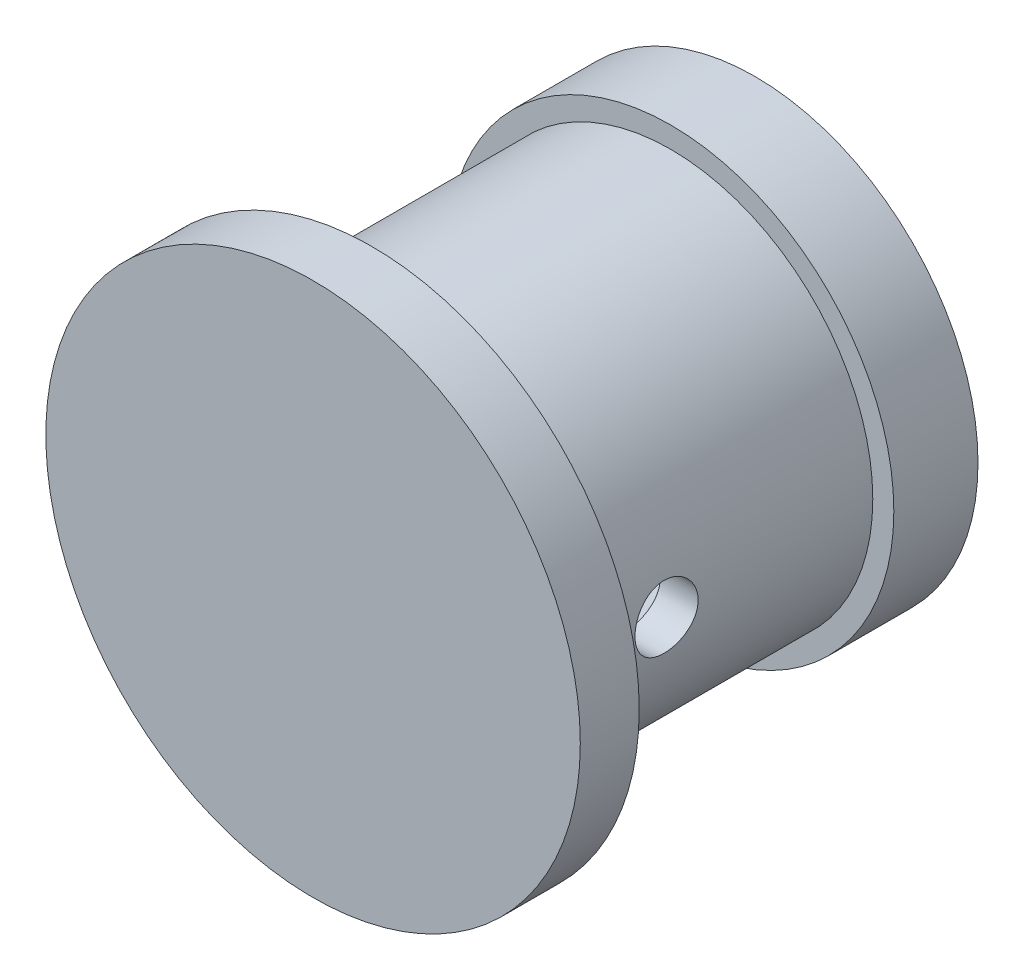
ISO-10303-21;
HEADER;
FILE_DESCRIPTION(('STEP AP214'),'2;1');
FILE_NAME('part.step','',(''),(''),'','','');
FILE_SCHEMA(('AUTOMOTIVE_DESIGN { 1 0 10303 214 1 1 1 1 }'));
ENDSEC;
DATA;
#1=APPLICATION_CONTEXT('core data for automotive mechanical design processes');
#2=APPLICATION_PROTOCOL_DEFINITION('international standard','automotive_design',2000,#1);
#3=PRODUCT_CONTEXT('',#1,'mechanical');
#4=PRODUCT('Part','Part','',(#3));
#5=PRODUCT_RELATED_PRODUCT_CATEGORY('part','',(#4));
#6=PRODUCT_DEFINITION_FORMATION('','',#4);
#7=PRODUCT_DEFINITION_CONTEXT('part definition',#1,'design');
#8=PRODUCT_DEFINITION('design','',#6,#7);
#9=PRODUCT_DEFINITION_SHAPE('','',#8);
#10=(LENGTH_UNIT() NAMED_UNIT(*) SI_UNIT(.MILLI.,.METRE.));
#11=(NAMED_UNIT(*) PLANE_ANGLE_UNIT() SI_UNIT($,.RADIAN.));
#12=(NAMED_UNIT(*) SI_UNIT($,.STERADIAN.) SOLID_ANGLE_UNIT());
#13=UNCERTAINTY_MEASURE_WITH_UNIT(LENGTH_MEASURE(1.E-05),#10,'distance_accuracy_value','');
#14=(GEOMETRIC_REPRESENTATION_CONTEXT(3) GLOBAL_UNCERTAINTY_ASSIGNED_CONTEXT((#13)) GLOBAL_UNIT_ASSIGNED_CONTEXT((#10,
#11,#12)) REPRESENTATION_CONTEXT('',''));
#15=CARTESIAN_POINT('',(0.,0.,0.));
#16=DIRECTION('',(0.,0.,1.));
#17=DIRECTION('',(1.,0.,0.));
#18=AXIS2_PLACEMENT_3D('',#15,#16,#17);
#19=CARTESIAN_POINT('',(0.,0.,2.));
#20=DIRECTION('',(0.,0.,-1.));
#21=DIRECTION('',(-1.,0.,0.));
#22=AXIS2_PLACEMENT_3D('',#19,#20,#21);
#23=CYLINDRICAL_SURFACE('',#22,3.9);
#24=CARTESIAN_POINT('',(0.,0.,0.));
#25=DIRECTION('',(0.,0.,1.));
#26=DIRECTION('',(1.,0.,0.));
#27=AXIS2_PLACEMENT_3D('',#24,#25,#26);
#28=CIRCLE('',#27,3.9);
#29=CARTESIAN_POINT('',(3.9,0.,0.));
#30=VERTEX_POINT('',#29);
#31=EDGE_CURVE('E44',#30,#30,#28,.T.);
#32=ORIENTED_EDGE('',*,*,#31,.F.);
#33=EDGE_LOOP('',(#32));
#34=FACE_BOUND('',#33,.T.);
#35=CARTESIAN_POINT('',(3.9,0.,6.15));
#36=CARTESIAN_POINT('',(3.89999923832951,-0.0417157980542261,6.15000157236591));
#37=CARTESIAN_POINT('',(3.89932379420987,-0.0834518319216465,6.1534921761894));
#38=CARTESIAN_POINT('',(3.89669443486819,-0.165746439927408,6.16735258345867));
#39=CARTESIAN_POINT('',(3.89473946456115,-0.20630401346838,6.17772806420581));
#40=CARTESIAN_POINT('',(3.88976959480018,-0.285039761238712,6.20502767414644));
#41=CARTESIAN_POINT('',(3.88675567477839,-0.323220095914121,6.22194575348209));
#42=CARTESIAN_POINT('',(3.87999646463515,-0.396197171527076,6.26183283837788));
#43=CARTESIAN_POINT('',(3.87625122778612,-0.430994158646533,6.28480140323585));
#44=CARTESIAN_POINT('',(3.86838969007306,-0.496657298922666,6.33644374971233));
#45=CARTESIAN_POINT('',(3.8642696864585,-0.527474788610262,6.36517884943533));
#46=CARTESIAN_POINT('',(3.856150240852,-0.58388300584685,6.4274067111584));
#47=CARTESIAN_POINT('',(3.85215080781833,-0.609473345836056,6.46089982562297));
#48=CARTESIAN_POINT('',(3.84468928205856,-0.654905038861865,6.53203919860734));
#49=CARTESIAN_POINT('',(3.84123195979528,-0.674696554350678,6.5697178293301));
#50=CARTESIAN_POINT('',(3.83529843768219,-0.707649660945562,6.64794297300797));
#51=CARTESIAN_POINT('',(3.83282214860921,-0.720811855005835,6.68848922476273));
#52=CARTESIAN_POINT('',(3.82916841038291,-0.739975831371414,6.77077685751576));
#53=CARTESIAN_POINT('',(3.82797554466172,-0.746062676374626,6.81249773000912));
#54=CARTESIAN_POINT('',(3.82697726327835,-0.751167270554283,6.896384291076));
#55=CARTESIAN_POINT('',(3.82717171663926,-0.750185687061576,6.93854993728307));
#56=CARTESIAN_POINT('',(3.82891207752539,-0.74125018682566,7.02151056694862));
#57=CARTESIAN_POINT('',(3.83043917839865,-0.733393291950161,7.06231645342943));
#58=CARTESIAN_POINT('',(3.83464320117064,-0.711083124407333,7.14201989493467));
#59=CARTESIAN_POINT('',(3.83732017422218,-0.696629558280993,7.18091736497618));
#60=CARTESIAN_POINT('',(3.84354181057073,-0.661442296377936,7.25598208314585));
#61=CARTESIAN_POINT('',(3.84709182212181,-0.640669696791684,7.2921306331524));
#62=CARTESIAN_POINT('',(3.85465604131889,-0.593461515268042,7.36046549134157));
#63=CARTESIAN_POINT('',(3.85867029841497,-0.567025329805939,7.39265137667751));
#64=CARTESIAN_POINT('',(3.86679247142909,-0.508718673398003,7.45270756026625));
#65=CARTESIAN_POINT('',(3.87090083596183,-0.476765283467978,7.48049735701104));
#66=CARTESIAN_POINT('',(3.87868716308693,-0.408607996846195,7.53033465219016));
#67=CARTESIAN_POINT('',(3.88236512092762,-0.372404053237343,7.55238208723235));
#68=CARTESIAN_POINT('',(3.88888424583095,-0.296687328746638,7.5901218141119));
#69=CARTESIAN_POINT('',(3.89172426781904,-0.25717011391292,7.60580542038515));
#70=CARTESIAN_POINT('',(3.89623874164927,-0.175995170759134,7.63028922700407));
#71=CARTESIAN_POINT('',(3.8979133238481,-0.134337682392701,7.63909019719956));
#72=CARTESIAN_POINT('',(3.89989023849144,-0.0507569745433844,7.64944612984607));
#73=CARTESIAN_POINT('',(3.90021344806363,-0.00884789339859487,7.65111134155231));
#74=CARTESIAN_POINT('',(3.89950898996532,0.0746497909778481,7.64744466684101));
#75=CARTESIAN_POINT('',(3.8984813922618,0.116238410696026,7.6421131428293));
#76=CARTESIAN_POINT('',(3.89520380615872,0.197562672774067,7.62469597680149));
#77=CARTESIAN_POINT('',(3.89296397194081,0.237310771117499,7.61266641647227));
#78=CARTESIAN_POINT('',(3.88751206346573,0.314225866800569,7.58225556596267));
#79=CARTESIAN_POINT('',(3.88429992056438,0.351392681675911,7.56387382731082));
#80=CARTESIAN_POINT('',(3.8772076396041,0.422558604801738,7.52103847704758));
#81=CARTESIAN_POINT('',(3.87332028676074,0.456516655578994,7.49651787253896));
#82=CARTESIAN_POINT('',(3.86532676553627,0.51987558162931,7.44219113295079));
#83=CARTESIAN_POINT('',(3.86122057561335,0.54927600714268,7.41238447684981));
#84=CARTESIAN_POINT('',(3.85318249151767,0.603106530494588,7.34783155158119));
#85=CARTESIAN_POINT('',(3.84925384547182,0.627461217715537,7.31302192491511));
#86=CARTESIAN_POINT('',(3.84208231127829,0.669977846499952,7.239740902718));
#87=CARTESIAN_POINT('',(3.83883939686218,0.688140025297119,7.20126964753543));
#88=CARTESIAN_POINT('',(3.83343227195322,0.717650652563154,7.12194409231613));
#89=CARTESIAN_POINT('',(3.8312627147556,0.729032932785833,7.08110275995974));
#90=CARTESIAN_POINT('',(3.82823606196423,0.744764371630338,6.99804147803805));
#91=CARTESIAN_POINT('',(3.82737880966904,0.749114369975666,6.95582169368778));
#92=CARTESIAN_POINT('',(3.8270820615194,0.750628535062043,6.87195799322353));
#93=CARTESIAN_POINT('',(3.82761908113154,0.747911730636622,6.83031626310977));
#94=CARTESIAN_POINT('',(3.82999814389848,0.735630799614123,6.74809501664808));
#95=CARTESIAN_POINT('',(3.83184017827541,0.726066719073556,6.70751549315737));
#96=CARTESIAN_POINT('',(3.83661159778881,0.700414043152496,6.6286390140474));
#97=CARTESIAN_POINT('',(3.83953872620097,0.684338982601164,6.59033751122471));
#98=CARTESIAN_POINT('',(3.84615199601922,0.646133912356583,6.51695629143272));
#99=CARTESIAN_POINT('',(3.84983819486471,0.624003444404754,6.48187681856732));
#100=CARTESIAN_POINT('',(3.8576267709082,0.573904691443286,6.41534052759461));
#101=CARTESIAN_POINT('',(3.86173478389533,0.545850029561536,6.38394939555536));
#102=CARTESIAN_POINT('',(3.86986260948437,0.484878715455026,6.32628078735171));
#103=CARTESIAN_POINT('',(3.87388240161115,0.451960947978224,6.30000448737957));
#104=CARTESIAN_POINT('',(3.88142597117673,0.38182087720399,6.25307609494333));
#105=CARTESIAN_POINT('',(3.8849446470373,0.344560480460825,6.23248008897926));
#106=CARTESIAN_POINT('',(3.89103957230098,0.267051677805124,6.19787376229078));
#107=CARTESIAN_POINT('',(3.89361669298088,0.226806075988456,6.18385734963933));
#108=CARTESIAN_POINT('',(3.89702203125066,0.155377069711663,6.16560462473562));
#109=CARTESIAN_POINT('',(3.89813237701001,0.124607231910502,6.1597630530743));
#110=CARTESIAN_POINT('',(3.89962163686166,0.0625620475544051,6.15196020490889));
#111=CARTESIAN_POINT('',(3.90000057125043,0.0312867150510979,6.1499988207306));
#112=CARTESIAN_POINT('',(3.9,0.,6.15));
#113=B_SPLINE_CURVE_WITH_KNOTS('',3,(#35,#36,#37,#38,#39,#40,#41,#42,#43,#44,#45,#46,#47,#48,
#49,#50,#51,#52,#53,#54,#55,#56,#57,#58,#59,#60,#61,#62,#63,#64,#65,#66,#67,#68,#69,#70,#71,#72,
#73,#74,#75,#76,#77,#78,#79,#80,#81,#82,#83,#84,#85,#86,#87,#88,#89,#90,#91,#92,#93,#94,#95,#96,
#97,#98,#99,#100,#101,#102,#103,#104,#105,#106,#107,#108,#109,#110,#111,#112),.UNSPECIFIED.,.T.,
.F.,(4,2,2,2,2,2,2,2,2,2,2,2,2,2,2,2,2,2,2,2,2,2,2,2,2,2,2,2,2,2,2,2,2,2,2,2,2,2,4),(0.,
0.125032962171771,0.250169155438955,0.375189912471988,0.500201565823747,0.626620597212298,
0.753048998365571,0.880534085472724,1.00800757538145,1.13393213695448,1.25984481013637,
1.38400879409832,1.50817830214821,1.63312829961092,1.75809161866104,1.88512918072696,
2.01216814514987,2.13937991802013,2.26657745971899,2.39180251709859,2.51702108852493,
2.6412066554825,2.76540099188296,2.89101471286217,3.01664082188772,3.1440270742995,
3.27140844602218,3.39814873963493,3.52487389809408,3.64947845137064,3.77408216653334,
3.89842817785498,4.02278360198573,4.14909571295895,4.27543683608095,4.40298408082016,
4.53041299779219,4.62418992164049,4.71796424316678),.UNSPECIFIED.);
#114=CARTESIAN_POINT('',(3.9,0.,6.15));
#115=VERTEX_POINT('',#114);
#116=EDGE_CURVE('E76',#115,#115,#113,.T.);
#117=ORIENTED_EDGE('',*,*,#116,.F.);
#118=EDGE_LOOP('',(#117));
#119=FACE_BOUND('',#118,.T.);
#120=CARTESIAN_POINT('',(-3.9,0.,7.65));
#121=CARTESIAN_POINT('',(-3.89999923832951,-0.0417157980542261,7.64999842763409));
#122=CARTESIAN_POINT('',(-3.89932379420987,-0.0834518319216465,7.6465078238106));
#123=CARTESIAN_POINT('',(-3.89669443486819,-0.165746439927408,7.63264741654133));
#124=CARTESIAN_POINT('',(-3.89473946456115,-0.20630401346838,7.62227193579419));
#125=CARTESIAN_POINT('',(-3.88976959480018,-0.285039761238712,7.59497232585356));
#126=CARTESIAN_POINT('',(-3.88675567477839,-0.323220095914121,7.57805424651791));
#127=CARTESIAN_POINT('',(-3.87999646463515,-0.396197171527076,7.53816716162212));
#128=CARTESIAN_POINT('',(-3.87625122778612,-0.430994158646533,7.51519859676415));
#129=CARTESIAN_POINT('',(-3.86838969007306,-0.496657298922666,7.46355625028766));
#130=CARTESIAN_POINT('',(-3.8642696864585,-0.527474788610262,7.43482115056467));
#131=CARTESIAN_POINT('',(-3.856150240852,-0.58388300584685,7.3725932888416));
#132=CARTESIAN_POINT('',(-3.85215080781833,-0.609473345836056,7.33910017437703));
#133=CARTESIAN_POINT('',(-3.84468928205856,-0.654905038861865,7.26796080139266));
#134=CARTESIAN_POINT('',(-3.84123195979528,-0.674696554350678,7.2302821706699));
#135=CARTESIAN_POINT('',(-3.83529843768219,-0.707649660945562,7.15205702699203));
#136=CARTESIAN_POINT('',(-3.83282214860921,-0.720811855005835,7.11151077523727));
#137=CARTESIAN_POINT('',(-3.82916841038291,-0.739975831371414,7.02922314248424));
#138=CARTESIAN_POINT('',(-3.82797554466172,-0.746062676374626,6.98750226999088));
#139=CARTESIAN_POINT('',(-3.82697726327835,-0.751167270554283,6.903615708924));
#140=CARTESIAN_POINT('',(-3.82717171663926,-0.750185687061576,6.86145006271693));
#141=CARTESIAN_POINT('',(-3.82891207752539,-0.74125018682566,6.77848943305138));
#142=CARTESIAN_POINT('',(-3.83043917839865,-0.733393291950161,6.73768354657057));
#143=CARTESIAN_POINT('',(-3.83464320117064,-0.711083124407333,6.65798010506533));
#144=CARTESIAN_POINT('',(-3.83732017422218,-0.696629558280993,6.61908263502382));
#145=CARTESIAN_POINT('',(-3.84354181057073,-0.661442296377936,6.54401791685415));
#146=CARTESIAN_POINT('',(-3.84709182212181,-0.640669696791685,6.5078693668476));
#147=CARTESIAN_POINT('',(-3.85465604131889,-0.593461515268042,6.43953450865843));
#148=CARTESIAN_POINT('',(-3.85867029841497,-0.567025329805939,6.40734862332249));
#149=CARTESIAN_POINT('',(-3.86679247142909,-0.508718673398003,6.34729243973375));
#150=CARTESIAN_POINT('',(-3.87090083596183,-0.476765283467979,6.31950264298896));
#151=CARTESIAN_POINT('',(-3.87868716308693,-0.408607996846196,6.26966534780984));
#152=CARTESIAN_POINT('',(-3.88236512092762,-0.372404053237343,6.24761791276766));
#153=CARTESIAN_POINT('',(-3.88888424583095,-0.296687328746638,6.2098781858881));
#154=CARTESIAN_POINT('',(-3.89172426781904,-0.25717011391292,6.19419457961485));
#155=CARTESIAN_POINT('',(-3.89623874164927,-0.175995170759135,6.16971077299593));
#156=CARTESIAN_POINT('',(-3.8979133238481,-0.134337682392701,6.16090980280044));
#157=CARTESIAN_POINT('',(-3.89989023849144,-0.0507569745433844,6.15055387015393));
#158=CARTESIAN_POINT('',(-3.90021344806363,-0.00884789339859488,6.14888865844769));
#159=CARTESIAN_POINT('',(-3.89950898996532,0.074649790977848,6.15255533315899));
#160=CARTESIAN_POINT('',(-3.8984813922618,0.116238410696026,6.1578868571707));
#161=CARTESIAN_POINT('',(-3.89520380615872,0.197562672774067,6.17530402319851));
#162=CARTESIAN_POINT('',(-3.89296397194081,0.237310771117499,6.18733358352773));
#163=CARTESIAN_POINT('',(-3.88751206346573,0.314225866800569,6.21774443403733));
#164=CARTESIAN_POINT('',(-3.88429992056438,0.351392681675911,6.23612617268918));
#165=CARTESIAN_POINT('',(-3.8772076396041,0.422558604801738,6.27896152295242));
#166=CARTESIAN_POINT('',(-3.87332028676074,0.456516655578994,6.30348212746104));
#167=CARTESIAN_POINT('',(-3.86532676553627,0.51987558162931,6.35780886704921));
#168=CARTESIAN_POINT('',(-3.86122057561335,0.54927600714268,6.38761552315019));
#169=CARTESIAN_POINT('',(-3.85318249151767,0.603106530494589,6.45216844841881));
#170=CARTESIAN_POINT('',(-3.84925384547182,0.627461217715537,6.48697807508489));
#171=CARTESIAN_POINT('',(-3.84208231127829,0.669977846499953,6.560259097282));
#172=CARTESIAN_POINT('',(-3.83883939686218,0.688140025297119,6.59873035246457));
#173=CARTESIAN_POINT('',(-3.83343227195322,0.717650652563155,6.67805590768387));
#174=CARTESIAN_POINT('',(-3.8312627147556,0.729032932785833,6.71889724004026));
#175=CARTESIAN_POINT('',(-3.82823606196423,0.744764371630338,6.80195852196195));
#176=CARTESIAN_POINT('',(-3.82737880966904,0.749114369975666,6.84417830631222));
#177=CARTESIAN_POINT('',(-3.8270820615194,0.750628535062043,6.92804200677647));
#178=CARTESIAN_POINT('',(-3.82761908113154,0.747911730636622,6.96968373689023));
#179=CARTESIAN_POINT('',(-3.82999814389848,0.735630799614123,7.05190498335192));
#180=CARTESIAN_POINT('',(-3.83184017827541,0.726066719073556,7.09248450684263));
#181=CARTESIAN_POINT('',(-3.83661159778881,0.700414043152496,7.1713609859526));
#182=CARTESIAN_POINT('',(-3.83953872620097,0.684338982601164,7.20966248877529));
#183=CARTESIAN_POINT('',(-3.84615199601922,0.646133912356583,7.28304370856728));
#184=CARTESIAN_POINT('',(-3.84983819486471,0.624003444404754,7.31812318143268));
#185=CARTESIAN_POINT('',(-3.8576267709082,0.573904691443286,7.38465947240539));
#186=CARTESIAN_POINT('',(-3.86173478389533,0.545850029561536,7.41605060444464));
#187=CARTESIAN_POINT('',(-3.86986260948437,0.484878715455026,7.47371921264829));
#188=CARTESIAN_POINT('',(-3.87388240161115,0.451960947978224,7.49999551262043));
#189=CARTESIAN_POINT('',(-3.88142597117673,0.38182087720399,7.54692390505667));
#190=CARTESIAN_POINT('',(-3.8849446470373,0.344560480460825,7.56751991102074));
#191=CARTESIAN_POINT('',(-3.89103957230098,0.267051677805124,7.60212623770922));
#192=CARTESIAN_POINT('',(-3.89361669298088,0.226806075988456,7.61614265036067));
#193=CARTESIAN_POINT('',(-3.89702203125066,0.155377069711663,7.63439537526438));
#194=CARTESIAN_POINT('',(-3.89813237701001,0.124607231910502,7.6402369469257));
#195=CARTESIAN_POINT('',(-3.89962163686166,0.0625620475544051,7.64803979509111));
#196=CARTESIAN_POINT('',(-3.90000057125043,0.0312867150510979,7.6500011792694));
#197=CARTESIAN_POINT('',(-3.9,0.,7.65));
#198=B_SPLINE_CURVE_WITH_KNOTS('',3,(#120,#121,#122,#123,#124,#125,#126,#127,#128,#129,#130,
#131,#132,#133,#134,#135,#136,#137,#138,#139,#140,#141,#142,#143,#144,#145,#146,#147,#148,#149,
#150,#151,#152,#153,#154,#155,#156,#157,#158,#159,#160,#161,#162,#163,#164,#165,#166,#167,#168,
#169,#170,#171,#172,#173,#174,#175,#176,#177,#178,#179,#180,#181,#182,#183,#184,#185,#186,#187,
#188,#189,#190,#191,#192,#193,#194,#195,#196,#197),.UNSPECIFIED.,.T.,.F.,(4,2,2,2,2,2,2,2,2,2,2,
2,2,2,2,2,2,2,2,2,2,2,2,2,2,2,2,2,2,2,2,2,2,2,2,2,2,2,4),(0.,0.125032962171771,
0.250169155438955,0.375189912471988,0.500201565823747,0.626620597212298,0.753048998365571,
0.880534085472724,1.00800757538145,1.13393213695448,1.25984481013637,1.38400879409832,
1.50817830214821,1.63312829961092,1.75809161866104,1.88512918072696,2.01216814514987,
2.13937991802013,2.26657745971899,2.39180251709859,2.51702108852493,2.6412066554825,
2.76540099188296,2.89101471286217,3.01664082188772,3.14402707429951,3.27140844602218,
3.39814873963493,3.52487389809408,3.64947845137064,3.77408216653334,3.89842817785498,
4.02278360198573,4.14909571295895,4.27543683608095,4.40298408082016,4.53041299779219,
4.62418992164049,4.71796424316678),.UNSPECIFIED.);
#199=CARTESIAN_POINT('',(-3.9,0.,7.65));
#200=VERTEX_POINT('',#199);
#201=EDGE_CURVE('E81',#200,#200,#198,.T.);
#202=ORIENTED_EDGE('',*,*,#201,.F.);
#203=EDGE_LOOP('',(#202));
#204=FACE_BOUND('',#203,.T.);
#205=CARTESIAN_POINT('',(0.,0.,9.1));
#206=DIRECTION('',(0.,0.,1.));
#207=DIRECTION('',(1.,0.,0.));
#208=AXIS2_PLACEMENT_3D('',#205,#206,#207);
#209=CIRCLE('',#208,3.9);
#210=CARTESIAN_POINT('',(3.9,0.,9.1));
#211=VERTEX_POINT('',#210);
#212=EDGE_CURVE('E56',#211,#211,#209,.T.);
#213=ORIENTED_EDGE('',*,*,#212,.T.);
#214=EDGE_LOOP('',(#213));
#215=FACE_BOUND('',#214,.T.);
#216=ADVANCED_FACE('F28',(#34,#119,#204,#215),#23,.F.);
#217=CARTESIAN_POINT('',(0.,0.,9.5));
#218=DIRECTION('',(0.,0.,-1.));
#219=DIRECTION('',(-1.,0.,0.));
#220=AXIS2_PLACEMENT_3D('',#217,#218,#219);
#221=CYLINDRICAL_SURFACE('',#220,4.8);
#222=CARTESIAN_POINT('',(0.,0.,2.));
#223=DIRECTION('',(0.,0.,1.));
#224=DIRECTION('',(1.,0.,0.));
#225=AXIS2_PLACEMENT_3D('',#222,#223,#224);
#226=CIRCLE('',#225,4.8);
#227=CARTESIAN_POINT('',(4.8,0.,2.));
#228=VERTEX_POINT('',#227);
#229=EDGE_CURVE('E103',#228,#228,#226,.T.);
#230=ORIENTED_EDGE('',*,*,#229,.T.);
#231=EDGE_LOOP('',(#230));
#232=FACE_BOUND('',#231,.T.);
#233=CARTESIAN_POINT('',(4.8,0.,6.15));
#234=CARTESIAN_POINT('',(4.79999931058345,-0.0418545291813098,6.15000170948145));
#235=CARTESIAN_POINT('',(4.79944683745722,-0.0837328214597111,6.15351543413207));
#236=CARTESIAN_POINT('',(4.79729609429278,-0.166317394493431,6.16747310738303));
#237=CARTESIAN_POINT('',(4.79569682653417,-0.207022518396995,6.17792366775105));
#238=CARTESIAN_POINT('',(4.79163209149733,-0.286053761414221,6.20543389884199));
#239=CARTESIAN_POINT('',(4.78916729868952,-0.324381705686971,6.22248842440848));
#240=CARTESIAN_POINT('',(4.78364338211446,-0.39762637531338,6.26270956354248));
#241=CARTESIAN_POINT('',(4.78058433558766,-0.432543543110492,6.28587538291078));
#242=CARTESIAN_POINT('',(4.77418280524307,-0.498275973495485,6.33786991450619));
#243=CARTESIAN_POINT('',(4.77083835417701,-0.529058243742794,6.36674009846707));
#244=CARTESIAN_POINT('',(4.76425822839086,-0.58536230646847,6.42923458448067));
#245=CARTESIAN_POINT('',(4.76102256015224,-0.610883785962576,6.46285916919006));
#246=CARTESIAN_POINT('',(4.75500728438233,-0.656071632986651,6.53413148140312));
#247=CARTESIAN_POINT('',(4.75223021935831,-0.675705820673975,6.57179984470854));
#248=CARTESIAN_POINT('',(4.7474736052271,-0.708356044791196,6.64995042325734));
#249=CARTESIAN_POINT('',(4.74549400890665,-0.72137247303019,6.69043247175317));
#250=CARTESIAN_POINT('',(4.74257590353311,-0.740314677966502,6.77271327034314));
#251=CARTESIAN_POINT('',(4.74162907959709,-0.746297116462488,6.81449867574564));
#252=CARTESIAN_POINT('',(4.74085851321532,-0.751177109272865,6.89849015666779));
#253=CARTESIAN_POINT('',(4.74103470086407,-0.750075104581398,6.94069620583981));
#254=CARTESIAN_POINT('',(4.74248265136562,-0.740863742426671,7.0239291095558));
#255=CARTESIAN_POINT('',(4.74374451655484,-0.73281768887908,7.06496316700594));
#256=CARTESIAN_POINT('',(4.74720616903642,-0.710045813501255,7.1450916019078));
#257=CARTESIAN_POINT('',(4.74940598491924,-0.695319788052397,7.18418592019216));
#258=CARTESIAN_POINT('',(4.75450652056387,-0.659540750848154,7.25951661380315));
#259=CARTESIAN_POINT('',(4.75741017926173,-0.638461116946647,7.29574013753192));
#260=CARTESIAN_POINT('',(4.76358913845029,-0.590592174439912,7.36415986070566));
#261=CARTESIAN_POINT('',(4.76686446536463,-0.56380245975905,7.39635577346624));
#262=CARTESIAN_POINT('',(4.77346135874669,-0.504927266466999,7.45617307398999));
#263=CARTESIAN_POINT('',(4.77678304090677,-0.472787401681618,7.48374094748084));
#264=CARTESIAN_POINT('',(4.78306537604348,-0.404309084213808,7.53309994369197));
#265=CARTESIAN_POINT('',(4.78602602718607,-0.367970610204396,7.55489103706705));
#266=CARTESIAN_POINT('',(4.79125619708111,-0.292078778116948,7.59208142202672));
#267=CARTESIAN_POINT('',(4.7935252456258,-0.252523255872138,7.6074763675599));
#268=CARTESIAN_POINT('',(4.79711268000203,-0.171344860409028,7.63138979023417));
#269=CARTESIAN_POINT('',(4.79843113562693,-0.12972213920616,7.63990877221995));
#270=CARTESIAN_POINT('',(4.79995953518183,-0.0460525010291202,7.64975678293506));
#271=CARTESIAN_POINT('',(4.80018081537858,-0.0040144384526102,7.65115934369285));
#272=CARTESIAN_POINT('',(4.79952085947381,0.0796963639234929,7.64693018839921));
#273=CARTESIAN_POINT('',(4.79863966049893,0.121369115977547,7.64129870922327));
#274=CARTESIAN_POINT('',(4.79588077107966,0.202942033879711,7.62322248369595));
#275=CARTESIAN_POINT('',(4.79400835264616,0.242850378616812,7.61081377251968));
#276=CARTESIAN_POINT('',(4.78947622705067,0.320020220356988,7.57957347168036));
#277=CARTESIAN_POINT('',(4.78681648023022,0.357281583911822,7.5607415584672));
#278=CARTESIAN_POINT('',(4.78097691822283,0.428421660675122,7.51701840266203));
#279=CARTESIAN_POINT('',(4.77779318599026,0.462271537135117,7.49208077397286));
#280=CARTESIAN_POINT('',(4.77127164139331,0.525332089523418,7.43691837422766));
#281=CARTESIAN_POINT('',(4.76793381927803,0.554542471341053,7.40669326823854));
#282=CARTESIAN_POINT('',(4.76144408260995,0.607764242330072,7.34148564083484));
#283=CARTESIAN_POINT('',(4.75829412357241,0.631726195752379,7.3064625458633));
#284=CARTESIAN_POINT('',(4.75257207841748,0.673426703179921,7.2328451779016));
#285=CARTESIAN_POINT('',(4.74999997566599,0.691165436334315,7.19425100775316));
#286=CARTESIAN_POINT('',(4.74573921405707,0.719840315834984,7.11473110778574));
#287=CARTESIAN_POINT('',(4.74404724704688,0.730801964843737,7.07381475937031));
#288=CARTESIAN_POINT('',(4.74172971084238,0.745692366121606,6.99069325690081));
#289=CARTESIAN_POINT('',(4.74110406115332,0.749621649254992,6.9484882003743));
#290=CARTESIAN_POINT('',(4.74099317413465,0.750322358072269,6.86448038522776));
#291=CARTESIAN_POINT('',(4.7414955481287,0.747171541645276,6.82267827091995));
#292=CARTESIAN_POINT('',(4.74355709682549,0.733968669767703,6.74020641085671));
#293=CARTESIAN_POINT('',(4.74511626923985,0.723916629260884,6.69953666264949));
#294=CARTESIAN_POINT('',(4.74911126656472,0.697224989675555,6.62050865200784));
#295=CARTESIAN_POINT('',(4.75154630686022,0.680591285215743,6.58214835652248));
#296=CARTESIAN_POINT('',(4.75701955214219,0.641216305639252,6.50875031589712));
#297=CARTESIAN_POINT('',(4.76005778103248,0.618474788462658,6.47371270251347));
#298=CARTESIAN_POINT('',(4.76643470427678,0.567249024417239,6.40756033676195));
#299=CARTESIAN_POINT('',(4.76977620348087,0.538707321284306,6.37649034101585));
#300=CARTESIAN_POINT('',(4.7763601309222,0.476812783914613,6.31955362908398));
#301=CARTESIAN_POINT('',(4.77960253602037,0.443458836235297,6.29368812042244));
#302=CARTESIAN_POINT('',(4.7856453073701,0.372650057653024,6.24775463309053));
#303=CARTESIAN_POINT('',(4.7884429032908,0.335171811642715,6.22772238817212));
#304=CARTESIAN_POINT('',(4.79325377951664,0.257355564707336,6.19426770114212));
#305=CARTESIAN_POINT('',(4.79526786042636,0.217020532974529,6.18083850823248));
#306=CARTESIAN_POINT('',(4.79783233759464,0.147094271973479,6.16397009367282));
#307=CARTESIAN_POINT('',(4.79864097487836,0.117931672695488,6.1587394528113));
#308=CARTESIAN_POINT('',(4.79972504609286,0.0591833393551747,6.15175382598628));
#309=CARTESIAN_POINT('',(4.80000048752389,0.0295976112507356,6.1499987911328));
#310=CARTESIAN_POINT('',(4.8,0.,6.15));
#311=B_SPLINE_CURVE_WITH_KNOTS('',3,(#233,#234,#235,#236,#237,#238,#239,#240,#241,#242,#243,
#244,#245,#246,#247,#248,#249,#250,#251,#252,#253,#254,#255,#256,#257,#258,#259,#260,#261,#262,
#263,#264,#265,#266,#267,#268,#269,#270,#271,#272,#273,#274,#275,#276,#277,#278,#279,#280,#281,
#282,#283,#284,#285,#286,#287,#288,#289,#290,#291,#292,#293,#294,#295,#296,#297,#298,#299,#300,
#301,#302,#303,#304,#305,#306,#307,#308,#309,#310),.UNSPECIFIED.,.T.,.F.,(4,2,2,2,2,2,2,2,2,2,2,
2,2,2,2,2,2,2,2,2,2,2,2,2,2,2,2,2,2,2,2,2,2,2,2,2,2,2,4),(0.,0.125455422143247,
0.251030592758404,0.376508123832308,0.50196935637609,0.628378704456598,0.754795570936265,
0.881891335817278,1.00897957502772,1.13503689340498,1.26108636501163,1.38599872806774,
1.51091489895315,1.63636193220704,1.7618178896762,1.8886371970031,2.01545714854148,
2.14236313126369,2.2692597954896,2.39484256201774,2.52042109958507,2.6453383342697,
2.77026186222609,2.89616562440901,3.02207736480425,3.14912844074877,3.27617585894694,
3.4027422311854,3.52929904868789,3.65447274479607,3.77964616985669,3.90470774089986,
4.02977426901404,4.15614603694662,4.2825470914269,4.40970691259953,4.53673645696884,
4.62545404905462,4.71417039317613),.UNSPECIFIED.);
#312=CARTESIAN_POINT('',(4.8,0.,6.15));
#313=VERTEX_POINT('',#312);
#314=EDGE_CURVE('E49',#313,#313,#311,.T.);
#315=ORIENTED_EDGE('',*,*,#314,.T.);
#316=EDGE_LOOP('',(#315));
#317=FACE_BOUND('',#316,.T.);
#318=CARTESIAN_POINT('',(-4.8,0.,7.65));
#319=CARTESIAN_POINT('',(-4.79999931058345,-0.0418545291813098,7.64999829051855));
#320=CARTESIAN_POINT('',(-4.79944683745722,-0.0837328214597111,7.64648456586793));
#321=CARTESIAN_POINT('',(-4.79729609429278,-0.166317394493431,7.63252689261697));
#322=CARTESIAN_POINT('',(-4.79569682653417,-0.207022518396995,7.62207633224895));
#323=CARTESIAN_POINT('',(-4.79163209149733,-0.286053761414221,7.59456610115801));
#324=CARTESIAN_POINT('',(-4.78916729868952,-0.324381705686971,7.57751157559152));
#325=CARTESIAN_POINT('',(-4.78364338211446,-0.39762637531338,7.53729043645752));
#326=CARTESIAN_POINT('',(-4.78058433558766,-0.432543543110492,7.51412461708922));
#327=CARTESIAN_POINT('',(-4.77418280524307,-0.498275973495485,7.46213008549381));
#328=CARTESIAN_POINT('',(-4.77083835417701,-0.529058243742794,7.43325990153293));
#329=CARTESIAN_POINT('',(-4.76425822839086,-0.58536230646847,7.37076541551933));
#330=CARTESIAN_POINT('',(-4.76102256015224,-0.610883785962576,7.33714083080994));
#331=CARTESIAN_POINT('',(-4.75500728438233,-0.656071632986651,7.26586851859688));
#332=CARTESIAN_POINT('',(-4.75223021935831,-0.675705820673975,7.22820015529146));
#333=CARTESIAN_POINT('',(-4.7474736052271,-0.708356044791196,7.15004957674266));
#334=CARTESIAN_POINT('',(-4.74549400890665,-0.72137247303019,7.10956752824683));
#335=CARTESIAN_POINT('',(-4.74257590353311,-0.740314677966502,7.02728672965686));
#336=CARTESIAN_POINT('',(-4.74162907959709,-0.746297116462488,6.98550132425436));
#337=CARTESIAN_POINT('',(-4.74085851321532,-0.751177109272865,6.90150984333221));
#338=CARTESIAN_POINT('',(-4.74103470086407,-0.750075104581398,6.85930379416019));
#339=CARTESIAN_POINT('',(-4.74248265136562,-0.740863742426671,6.7760708904442));
#340=CARTESIAN_POINT('',(-4.74374451655484,-0.73281768887908,6.73503683299406));
#341=CARTESIAN_POINT('',(-4.74720616903642,-0.710045813501255,6.6549083980922));
#342=CARTESIAN_POINT('',(-4.74940598491924,-0.695319788052397,6.61581407980784));
#343=CARTESIAN_POINT('',(-4.75450652056387,-0.659540750848154,6.54048338619685));
#344=CARTESIAN_POINT('',(-4.75741017926173,-0.638461116946647,6.50425986246808));
#345=CARTESIAN_POINT('',(-4.76358913845029,-0.590592174439912,6.43584013929434));
#346=CARTESIAN_POINT('',(-4.76686446536463,-0.56380245975905,6.40364422653376));
#347=CARTESIAN_POINT('',(-4.77346135874669,-0.504927266466999,6.34382692601001));
#348=CARTESIAN_POINT('',(-4.77678304090677,-0.472787401681618,6.31625905251916));
#349=CARTESIAN_POINT('',(-4.78306537604348,-0.404309084213808,6.26690005630803));
#350=CARTESIAN_POINT('',(-4.78602602718607,-0.367970610204396,6.24510896293295));
#351=CARTESIAN_POINT('',(-4.79125619708111,-0.292078778116948,6.20791857797328));
#352=CARTESIAN_POINT('',(-4.7935252456258,-0.252523255872138,6.1925236324401));
#353=CARTESIAN_POINT('',(-4.79711268000203,-0.171344860409028,6.16861020976583));
#354=CARTESIAN_POINT('',(-4.79843113562693,-0.12972213920616,6.16009122778005));
#355=CARTESIAN_POINT('',(-4.79995953518183,-0.0460525010291202,6.15024321706494));
#356=CARTESIAN_POINT('',(-4.80018081537858,-0.0040144384526102,6.14884065630715));
#357=CARTESIAN_POINT('',(-4.79952085947381,0.0796963639234929,6.15306981160079));
#358=CARTESIAN_POINT('',(-4.79863966049893,0.121369115977547,6.15870129077673));
#359=CARTESIAN_POINT('',(-4.79588077107966,0.202942033879711,6.17677751630405));
#360=CARTESIAN_POINT('',(-4.79400835264616,0.242850378616812,6.18918622748032));
#361=CARTESIAN_POINT('',(-4.78947622705067,0.320020220356988,6.22042652831964));
#362=CARTESIAN_POINT('',(-4.78681648023022,0.357281583911822,6.2392584415328));
#363=CARTESIAN_POINT('',(-4.78097691822283,0.428421660675122,6.28298159733797));
#364=CARTESIAN_POINT('',(-4.77779318599026,0.462271537135117,6.30791922602714));
#365=CARTESIAN_POINT('',(-4.77127164139331,0.525332089523418,6.36308162577234));
#366=CARTESIAN_POINT('',(-4.76793381927803,0.554542471341053,6.39330673176145));
#367=CARTESIAN_POINT('',(-4.76144408260995,0.607764242330072,6.45851435916516));
#368=CARTESIAN_POINT('',(-4.75829412357241,0.631726195752379,6.4935374541367));
#369=CARTESIAN_POINT('',(-4.75257207841748,0.673426703179921,6.5671548220984));
#370=CARTESIAN_POINT('',(-4.74999997566599,0.691165436334315,6.60574899224684));
#371=CARTESIAN_POINT('',(-4.74573921405707,0.719840315834984,6.68526889221426));
#372=CARTESIAN_POINT('',(-4.74404724704688,0.730801964843737,6.72618524062969));
#373=CARTESIAN_POINT('',(-4.74172971084238,0.745692366121606,6.80930674309919));
#374=CARTESIAN_POINT('',(-4.74110406115332,0.749621649254992,6.8515117996257));
#375=CARTESIAN_POINT('',(-4.74099317413465,0.750322358072269,6.93551961477224));
#376=CARTESIAN_POINT('',(-4.7414955481287,0.747171541645276,6.97732172908005));
#377=CARTESIAN_POINT('',(-4.74355709682549,0.733968669767703,7.05979358914329));
#378=CARTESIAN_POINT('',(-4.74511626923985,0.723916629260884,7.10046333735051));
#379=CARTESIAN_POINT('',(-4.74911126656472,0.697224989675555,7.17949134799216));
#380=CARTESIAN_POINT('',(-4.75154630686022,0.680591285215743,7.21785164347752));
#381=CARTESIAN_POINT('',(-4.75701955214219,0.641216305639251,7.29124968410288));
#382=CARTESIAN_POINT('',(-4.76005778103248,0.618474788462658,7.32628729748653));
#383=CARTESIAN_POINT('',(-4.76643470427678,0.567249024417239,7.39243966323805));
#384=CARTESIAN_POINT('',(-4.76977620348087,0.538707321284305,7.42350965898415));
#385=CARTESIAN_POINT('',(-4.7763601309222,0.476812783914612,7.48044637091602));
#386=CARTESIAN_POINT('',(-4.77960253602037,0.443458836235297,7.50631187957756));
#387=CARTESIAN_POINT('',(-4.7856453073701,0.372650057653024,7.55224536690947));
#388=CARTESIAN_POINT('',(-4.7884429032908,0.335171811642714,7.57227761182788));
#389=CARTESIAN_POINT('',(-4.79325377951664,0.257355564707335,7.60573229885788));
#390=CARTESIAN_POINT('',(-4.79526786042636,0.217020532974529,7.61916149176752));
#391=CARTESIAN_POINT('',(-4.79783233759464,0.147094271973479,7.63602990632718));
#392=CARTESIAN_POINT('',(-4.79864097487836,0.117931672695488,7.6412605471887));
#393=CARTESIAN_POINT('',(-4.79972504609286,0.0591833393551747,7.64824617401372));
#394=CARTESIAN_POINT('',(-4.80000048752389,0.0295976112507356,7.6500012088672));
#395=CARTESIAN_POINT('',(-4.8,0.,7.65));
#396=B_SPLINE_CURVE_WITH_KNOTS('',3,(#318,#319,#320,#321,#322,#323,#324,#325,#326,#327,#328,
#329,#330,#331,#332,#333,#334,#335,#336,#337,#338,#339,#340,#341,#342,#343,#344,#345,#346,#347,
#348,#349,#350,#351,#352,#353,#354,#355,#356,#357,#358,#359,#360,#361,#362,#363,#364,#365,#366,
#367,#368,#369,#370,#371,#372,#373,#374,#375,#376,#377,#378,#379,#380,#381,#382,#383,#384,#385,
#386,#387,#388,#389,#390,#391,#392,#393,#394,#395),.UNSPECIFIED.,.T.,.F.,(4,2,2,2,2,2,2,2,2,2,2,
2,2,2,2,2,2,2,2,2,2,2,2,2,2,2,2,2,2,2,2,2,2,2,2,2,2,2,4),(0.,0.125455422143247,
0.251030592758404,0.376508123832308,0.50196935637609,0.628378704456598,0.754795570936265,
0.881891335817278,1.00897957502772,1.13503689340498,1.26108636501163,1.38599872806774,
1.51091489895315,1.63636193220704,1.7618178896762,1.8886371970031,2.01545714854148,
2.14236313126369,2.2692597954896,2.39484256201774,2.52042109958507,2.6453383342697,
2.77026186222609,2.89616562440901,3.02207736480425,3.14912844074877,3.27617585894694,
3.4027422311854,3.52929904868789,3.65447274479607,3.77964616985669,3.90470774089986,
4.02977426901405,4.15614603694662,4.2825470914269,4.40970691259953,4.53673645696884,
4.62545404905462,4.71417039317613),.UNSPECIFIED.);
#397=CARTESIAN_POINT('',(-4.8,0.,7.65));
#398=VERTEX_POINT('',#397);
#399=EDGE_CURVE('E55',#398,#398,#396,.T.);
#400=ORIENTED_EDGE('',*,*,#399,.T.);
#401=EDGE_LOOP('',(#400));
#402=FACE_BOUND('',#401,.T.);
#403=CARTESIAN_POINT('',(0.,0.,9.1));
#404=DIRECTION('',(0.,0.,1.));
#405=DIRECTION('',(1.,0.,0.));
#406=AXIS2_PLACEMENT_3D('',#403,#404,#405);
#407=CIRCLE('',#406,4.8);
#408=CARTESIAN_POINT('',(4.8,0.,9.1));
#409=VERTEX_POINT('',#408);
#410=EDGE_CURVE('E10',#409,#409,#407,.T.);
#411=ORIENTED_EDGE('',*,*,#410,.F.);
#412=EDGE_LOOP('',(#411));
#413=FACE_BOUND('',#412,.T.);
#414=ADVANCED_FACE('F59',(#232,#317,#402,#413),#221,.T.);
#415=CARTESIAN_POINT('',(0.,0.,2.));
#416=DIRECTION('',(0.,0.,1.));
#417=DIRECTION('',(1.,0.,0.));
#418=AXIS2_PLACEMENT_3D('',#415,#416,#417);
#419=PLANE('',#418);
#420=CARTESIAN_POINT('',(0.,0.,2.));
#421=DIRECTION('',(0.,0.,1.));
#422=DIRECTION('',(1.,0.,0.));
#423=AXIS2_PLACEMENT_3D('',#420,#421,#422);
#424=CIRCLE('',#423,5.3);
#425=CARTESIAN_POINT('',(5.3,0.,2.));
#426=VERTEX_POINT('',#425);
#427=EDGE_CURVE('E35',#426,#426,#424,.T.);
#428=ORIENTED_EDGE('',*,*,#427,.T.);
#429=EDGE_LOOP('',(#428));
#430=FACE_BOUND('',#429,.T.);
#431=ORIENTED_EDGE('',*,*,#229,.F.);
#432=EDGE_LOOP('',(#431));
#433=FACE_BOUND('',#432,.T.);
#434=ADVANCED_FACE('F89',(#430,#433),#419,.T.);
#435=CARTESIAN_POINT('',(0.,0.,0.));
#436=DIRECTION('',(0.,0.,1.));
#437=DIRECTION('',(1.,0.,0.));
#438=AXIS2_PLACEMENT_3D('',#435,#436,#437);
#439=PLANE('',#438);
#440=CARTESIAN_POINT('',(0.,0.,0.));
#441=DIRECTION('',(0.,0.,1.));
#442=DIRECTION('',(1.,0.,0.));
#443=AXIS2_PLACEMENT_3D('',#440,#441,#442);
#444=CIRCLE('',#443,5.3);
#445=CARTESIAN_POINT('',(5.3,0.,0.));
#446=VERTEX_POINT('',#445);
#447=EDGE_CURVE('E39',#446,#446,#444,.T.);
#448=ORIENTED_EDGE('',*,*,#447,.F.);
#449=EDGE_LOOP('',(#448));
#450=FACE_BOUND('',#449,.T.);
#451=ORIENTED_EDGE('',*,*,#31,.T.);
#452=EDGE_LOOP('',(#451));
#453=FACE_BOUND('',#452,.T.);
#454=ADVANCED_FACE('F92',(#450,#453),#439,.F.);
#455=CARTESIAN_POINT('',(0.,0.,2.));
#456=DIRECTION('',(0.,0.,-1.));
#457=DIRECTION('',(-1.,0.,0.));
#458=AXIS2_PLACEMENT_3D('',#455,#456,#457);
#459=CYLINDRICAL_SURFACE('',#458,5.3);
#460=ORIENTED_EDGE('',*,*,#427,.F.);
#461=EDGE_LOOP('',(#460));
#462=FACE_BOUND('',#461,.T.);
#463=ORIENTED_EDGE('',*,*,#447,.T.);
#464=EDGE_LOOP('',(#463));
#465=FACE_BOUND('',#464,.T.);
#466=ADVANCED_FACE('F30',(#462,#465),#459,.T.);
#467=CARTESIAN_POINT('',(-5.3,0.,6.9));
#468=DIRECTION('',(1.,0.,0.));
#469=DIRECTION('',(0.,0.,-1.));
#470=AXIS2_PLACEMENT_3D('',#467,#468,#469);
#471=CYLINDRICAL_SURFACE('',#470,0.75);
#472=ORIENTED_EDGE('',*,*,#116,.T.);
#473=EDGE_LOOP('',(#472));
#474=FACE_BOUND('',#473,.T.);
#475=ORIENTED_EDGE('',*,*,#314,.F.);
#476=EDGE_LOOP('',(#475));
#477=FACE_BOUND('',#476,.T.);
#478=ADVANCED_FACE('F67',(#474,#477),#471,.F.);
#479=ORIENTED_EDGE('',*,*,#201,.T.);
#480=EDGE_LOOP('',(#479));
#481=FACE_BOUND('',#480,.T.);
#482=ORIENTED_EDGE('',*,*,#399,.F.);
#483=EDGE_LOOP('',(#482));
#484=FACE_BOUND('',#483,.T.);
#485=ADVANCED_FACE('F62',(#481,#484),#471,.F.);
#486=CARTESIAN_POINT('',(0.,0.,10.5));
#487=DIRECTION('',(0.,0.,1.));
#488=DIRECTION('',(1.,0.,0.));
#489=AXIS2_PLACEMENT_3D('',#486,#487,#488);
#490=PLANE('',#489);
#491=CARTESIAN_POINT('',(0.,0.,10.5));
#492=DIRECTION('',(0.,0.,1.));
#493=DIRECTION('',(1.,0.,0.));
#494=AXIS2_PLACEMENT_3D('',#491,#492,#493);
#495=CIRCLE('',#494,6.35);
#496=CARTESIAN_POINT('',(6.35,0.,10.5));
#497=VERTEX_POINT('',#496);
#498=EDGE_CURVE('E117',#497,#497,#495,.T.);
#499=ORIENTED_EDGE('',*,*,#498,.T.);
#500=EDGE_LOOP('',(#499));
#501=FACE_BOUND('',#500,.T.);
#502=ADVANCED_FACE('F66',(#501),#490,.T.);
#503=CARTESIAN_POINT('',(0.,0.,9.1));
#504=DIRECTION('',(0.,0.,1.));
#505=DIRECTION('',(1.,0.,0.));
#506=AXIS2_PLACEMENT_3D('',#503,#504,#505);
#507=CYLINDRICAL_SURFACE('',#506,6.35);
#508=CARTESIAN_POINT('',(0.,0.,9.1));
#509=DIRECTION('',(0.,0.,1.));
#510=DIRECTION('',(1.,0.,0.));
#511=AXIS2_PLACEMENT_3D('',#508,#509,#510);
#512=CIRCLE('',#511,6.35);
#513=CARTESIAN_POINT('',(6.35,0.,9.1));
#514=VERTEX_POINT('',#513);
#515=EDGE_CURVE('E115',#514,#514,#512,.T.);
#516=ORIENTED_EDGE('',*,*,#515,.T.);
#517=EDGE_LOOP('',(#516));
#518=FACE_BOUND('',#517,.T.);
#519=ORIENTED_EDGE('',*,*,#498,.F.);
#520=EDGE_LOOP('',(#519));
#521=FACE_BOUND('',#520,.T.);
#522=ADVANCED_FACE('F69',(#518,#521),#507,.T.);
#523=CARTESIAN_POINT('',(0.,0.,9.1));
#524=DIRECTION('',(0.,0.,1.));
#525=DIRECTION('',(1.,0.,0.));
#526=AXIS2_PLACEMENT_3D('',#523,#524,#525);
#527=PLANE('',#526);
#528=ORIENTED_EDGE('',*,*,#515,.F.);
#529=EDGE_LOOP('',(#528));
#530=FACE_BOUND('',#529,.T.);
#531=ORIENTED_EDGE('',*,*,#410,.T.);
#532=EDGE_LOOP('',(#531));
#533=FACE_BOUND('',#532,.T.);
#534=ADVANCED_FACE('F126',(#530,#533),#527,.F.);
#535=ORIENTED_EDGE('',*,*,#212,.F.);
#536=EDGE_LOOP('',(#535));
#537=FACE_BOUND('',#536,.T.);
#538=ADVANCED_FACE('F131',(#537),#527,.F.);
#539=CLOSED_SHELL('',(#216,#414,#434,#454,#466,#478,#485,#502,#522,#534,#538));
#540=MANIFOLD_SOLID_BREP('B2',#539);
#541=ADVANCED_BREP_SHAPE_REPRESENTATION('',(#18,#540),#14);
#542=SHAPE_DEFINITION_REPRESENTATION(#9,#541);
ENDSEC;
END-ISO-10303-21;
